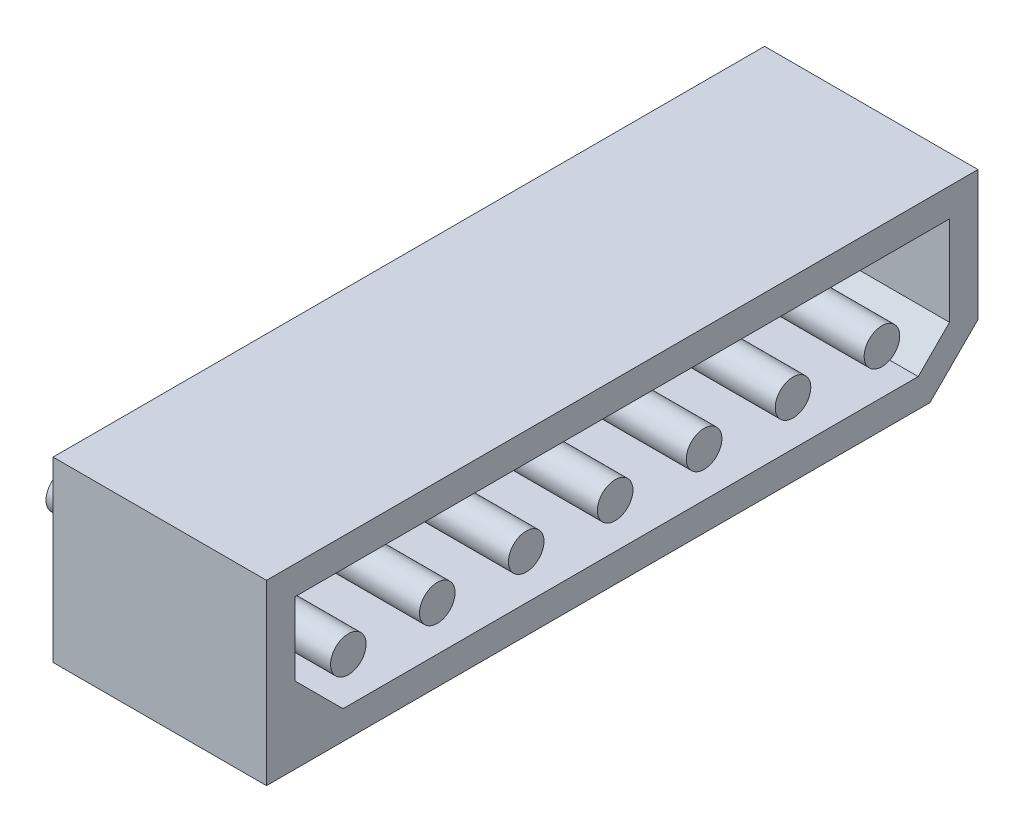
ISO-10303-21;
HEADER;
FILE_DESCRIPTION(('STEP AP214'),'2;1');
FILE_NAME('part.step','',(''),(''),'','','');
FILE_SCHEMA(('AUTOMOTIVE_DESIGN { 1 0 10303 214 1 1 1 1 }'));
ENDSEC;
DATA;
#1=APPLICATION_CONTEXT('core data for automotive mechanical design processes');
#2=APPLICATION_PROTOCOL_DEFINITION('international standard','automotive_design',2000,#1);
#3=PRODUCT_CONTEXT('',#1,'mechanical');
#4=PRODUCT('Part','Part','',(#3));
#5=PRODUCT_RELATED_PRODUCT_CATEGORY('part','',(#4));
#6=PRODUCT_DEFINITION_FORMATION('','',#4);
#7=PRODUCT_DEFINITION_CONTEXT('part definition',#1,'design');
#8=PRODUCT_DEFINITION('design','',#6,#7);
#9=PRODUCT_DEFINITION_SHAPE('','',#8);
#10=(LENGTH_UNIT() NAMED_UNIT(*) SI_UNIT(.MILLI.,.METRE.));
#11=(NAMED_UNIT(*) PLANE_ANGLE_UNIT() SI_UNIT($,.RADIAN.));
#12=(NAMED_UNIT(*) SI_UNIT($,.STERADIAN.) SOLID_ANGLE_UNIT());
#13=UNCERTAINTY_MEASURE_WITH_UNIT(LENGTH_MEASURE(1.E-05),#10,'distance_accuracy_value','');
#14=(GEOMETRIC_REPRESENTATION_CONTEXT(3) GLOBAL_UNCERTAINTY_ASSIGNED_CONTEXT((#13)) GLOBAL_UNIT_ASSIGNED_CONTEXT((#10,
#11,#12)) REPRESENTATION_CONTEXT('',''));
#15=CARTESIAN_POINT('',(0.,0.,0.));
#16=DIRECTION('',(0.,0.,1.));
#17=DIRECTION('',(1.,0.,0.));
#18=AXIS2_PLACEMENT_3D('',#15,#16,#17);
#19=CARTESIAN_POINT('',(5.8,-0.65,-7.5));
#20=DIRECTION('',(1.,0.,0.));
#21=DIRECTION('',(0.,0.,-1.));
#22=AXIS2_PLACEMENT_3D('',#19,#20,#21);
#23=PLANE('',#22);
#24=CARTESIAN_POINT('',(5.8,-0.65,-7.5));
#25=DIRECTION('',(1.,0.,0.));
#26=DIRECTION('',(0.,0.,-1.));
#27=AXIS2_PLACEMENT_3D('',#24,#25,#26);
#28=CIRCLE('',#27,0.5);
#29=CARTESIAN_POINT('',(5.8,-0.65,-8.));
#30=VERTEX_POINT('',#29);
#31=EDGE_CURVE('E19',#30,#30,#28,.F.);
#32=ORIENTED_EDGE('',*,*,#31,.F.);
#33=EDGE_LOOP('',(#32));
#34=FACE_BOUND('',#33,.T.);
#35=ADVANCED_FACE('F16',(#34),#23,.T.);
#36=CARTESIAN_POINT('',(5.8,-0.65,-5.));
#37=DIRECTION('',(1.,0.,0.));
#38=DIRECTION('',(0.,0.,-1.));
#39=AXIS2_PLACEMENT_3D('',#36,#37,#38);
#40=PLANE('',#39);
#41=CARTESIAN_POINT('',(5.8,-0.65,-5.));
#42=DIRECTION('',(1.,0.,0.));
#43=DIRECTION('',(0.,0.,-1.));
#44=AXIS2_PLACEMENT_3D('',#41,#42,#43);
#45=CIRCLE('',#44,0.5);
#46=CARTESIAN_POINT('',(5.8,-0.65,-5.5));
#47=VERTEX_POINT('',#46);
#48=EDGE_CURVE('E203',#47,#47,#45,.F.);
#49=ORIENTED_EDGE('',*,*,#48,.F.);
#50=EDGE_LOOP('',(#49));
#51=FACE_BOUND('',#50,.T.);
#52=ADVANCED_FACE('F214',(#51),#40,.T.);
#53=CARTESIAN_POINT('',(5.8,-0.65,-2.5));
#54=DIRECTION('',(1.,0.,0.));
#55=DIRECTION('',(0.,0.,-1.));
#56=AXIS2_PLACEMENT_3D('',#53,#54,#55);
#57=PLANE('',#56);
#58=CARTESIAN_POINT('',(5.8,-0.65,-2.5));
#59=DIRECTION('',(1.,0.,0.));
#60=DIRECTION('',(0.,0.,-1.));
#61=AXIS2_PLACEMENT_3D('',#58,#59,#60);
#62=CIRCLE('',#61,0.5);
#63=CARTESIAN_POINT('',(5.8,-0.65,-3.));
#64=VERTEX_POINT('',#63);
#65=EDGE_CURVE('E201',#64,#64,#62,.F.);
#66=ORIENTED_EDGE('',*,*,#65,.F.);
#67=EDGE_LOOP('',(#66));
#68=FACE_BOUND('',#67,.T.);
#69=ADVANCED_FACE('F219',(#68),#57,.T.);
#70=CARTESIAN_POINT('',(5.8,-0.65,0.));
#71=DIRECTION('',(1.,0.,0.));
#72=DIRECTION('',(0.,0.,-1.));
#73=AXIS2_PLACEMENT_3D('',#70,#71,#72);
#74=PLANE('',#73);
#75=CARTESIAN_POINT('',(5.8,-0.65,0.));
#76=DIRECTION('',(1.,0.,0.));
#77=DIRECTION('',(0.,0.,-1.));
#78=AXIS2_PLACEMENT_3D('',#75,#76,#77);
#79=CIRCLE('',#78,0.5);
#80=CARTESIAN_POINT('',(5.8,-0.65,-0.5));
#81=VERTEX_POINT('',#80);
#82=EDGE_CURVE('E198',#81,#81,#79,.F.);
#83=ORIENTED_EDGE('',*,*,#82,.F.);
#84=EDGE_LOOP('',(#83));
#85=FACE_BOUND('',#84,.T.);
#86=ADVANCED_FACE('F367',(#85),#74,.T.);
#87=CARTESIAN_POINT('',(5.8,-0.65,2.5));
#88=DIRECTION('',(1.,0.,0.));
#89=DIRECTION('',(0.,0.,-1.));
#90=AXIS2_PLACEMENT_3D('',#87,#88,#89);
#91=PLANE('',#90);
#92=CARTESIAN_POINT('',(5.8,-0.65,2.5));
#93=DIRECTION('',(1.,0.,0.));
#94=DIRECTION('',(0.,0.,-1.));
#95=AXIS2_PLACEMENT_3D('',#92,#93,#94);
#96=CIRCLE('',#95,0.5);
#97=CARTESIAN_POINT('',(5.8,-0.65,2.));
#98=VERTEX_POINT('',#97);
#99=EDGE_CURVE('E195',#98,#98,#96,.F.);
#100=ORIENTED_EDGE('',*,*,#99,.F.);
#101=EDGE_LOOP('',(#100));
#102=FACE_BOUND('',#101,.T.);
#103=ADVANCED_FACE('F363',(#102),#91,.T.);
#104=CARTESIAN_POINT('',(5.8,-0.65,5.));
#105=DIRECTION('',(1.,0.,0.));
#106=DIRECTION('',(0.,0.,-1.));
#107=AXIS2_PLACEMENT_3D('',#104,#105,#106);
#108=PLANE('',#107);
#109=CARTESIAN_POINT('',(5.8,-0.65,5.));
#110=DIRECTION('',(1.,0.,0.));
#111=DIRECTION('',(0.,0.,-1.));
#112=AXIS2_PLACEMENT_3D('',#109,#110,#111);
#113=CIRCLE('',#112,0.5);
#114=CARTESIAN_POINT('',(5.8,-0.65,4.5));
#115=VERTEX_POINT('',#114);
#116=EDGE_CURVE('E192',#115,#115,#113,.F.);
#117=ORIENTED_EDGE('',*,*,#116,.F.);
#118=EDGE_LOOP('',(#117));
#119=FACE_BOUND('',#118,.T.);
#120=ADVANCED_FACE('F359',(#119),#108,.T.);
#121=CARTESIAN_POINT('',(5.8,-0.65,7.5));
#122=DIRECTION('',(1.,0.,0.));
#123=DIRECTION('',(0.,0.,-1.));
#124=AXIS2_PLACEMENT_3D('',#121,#122,#123);
#125=PLANE('',#124);
#126=CARTESIAN_POINT('',(5.8,-0.65,7.5));
#127=DIRECTION('',(1.,0.,0.));
#128=DIRECTION('',(0.,0.,-1.));
#129=AXIS2_PLACEMENT_3D('',#126,#127,#128);
#130=CIRCLE('',#129,0.5);
#131=CARTESIAN_POINT('',(5.8,-0.65,7.));
#132=VERTEX_POINT('',#131);
#133=EDGE_CURVE('E189',#132,#132,#130,.F.);
#134=ORIENTED_EDGE('',*,*,#133,.F.);
#135=EDGE_LOOP('',(#134));
#136=FACE_BOUND('',#135,.T.);
#137=ADVANCED_FACE('F356',(#136),#125,.T.);
#138=CARTESIAN_POINT('',(5.8,-0.65,-7.5));
#139=DIRECTION('',(1.,0.,0.));
#140=DIRECTION('',(0.,0.,-1.));
#141=AXIS2_PLACEMENT_3D('',#138,#139,#140);
#142=CYLINDRICAL_SURFACE('',#141,0.5);
#143=ORIENTED_EDGE('',*,*,#31,.T.);
#144=EDGE_LOOP('',(#143));
#145=FACE_BOUND('',#144,.T.);
#146=CARTESIAN_POINT('',(0.8,-0.65,-7.5));
#147=DIRECTION('',(1.,0.,0.));
#148=DIRECTION('',(0.,0.,-1.));
#149=AXIS2_PLACEMENT_3D('',#146,#147,#148);
#150=CIRCLE('',#149,0.5);
#151=CARTESIAN_POINT('',(0.8,-0.65,-8.));
#152=VERTEX_POINT('',#151);
#153=EDGE_CURVE('E186',#152,#152,#150,.F.);
#154=ORIENTED_EDGE('',*,*,#153,.F.);
#155=EDGE_LOOP('',(#154));
#156=FACE_BOUND('',#155,.T.);
#157=ADVANCED_FACE('F210',(#145,#156),#142,.T.);
#158=CARTESIAN_POINT('',(5.8,-0.65,-5.));
#159=DIRECTION('',(1.,0.,0.));
#160=DIRECTION('',(0.,0.,-1.));
#161=AXIS2_PLACEMENT_3D('',#158,#159,#160);
#162=CYLINDRICAL_SURFACE('',#161,0.5);
#163=ORIENTED_EDGE('',*,*,#48,.T.);
#164=EDGE_LOOP('',(#163));
#165=FACE_BOUND('',#164,.T.);
#166=CARTESIAN_POINT('',(0.8,-0.65,-5.));
#167=DIRECTION('',(1.,0.,0.));
#168=DIRECTION('',(0.,0.,-1.));
#169=AXIS2_PLACEMENT_3D('',#166,#167,#168);
#170=CIRCLE('',#169,0.5);
#171=CARTESIAN_POINT('',(0.8,-0.65,-5.5));
#172=VERTEX_POINT('',#171);
#173=EDGE_CURVE('E183',#172,#172,#170,.F.);
#174=ORIENTED_EDGE('',*,*,#173,.F.);
#175=EDGE_LOOP('',(#174));
#176=FACE_BOUND('',#175,.T.);
#177=ADVANCED_FACE('F350',(#165,#176),#162,.T.);
#178=CARTESIAN_POINT('',(5.8,-0.65,-2.5));
#179=DIRECTION('',(1.,0.,0.));
#180=DIRECTION('',(0.,0.,-1.));
#181=AXIS2_PLACEMENT_3D('',#178,#179,#180);
#182=CYLINDRICAL_SURFACE('',#181,0.5);
#183=ORIENTED_EDGE('',*,*,#65,.T.);
#184=EDGE_LOOP('',(#183));
#185=FACE_BOUND('',#184,.T.);
#186=CARTESIAN_POINT('',(0.8,-0.65,-2.5));
#187=DIRECTION('',(1.,0.,0.));
#188=DIRECTION('',(0.,0.,-1.));
#189=AXIS2_PLACEMENT_3D('',#186,#187,#188);
#190=CIRCLE('',#189,0.5);
#191=CARTESIAN_POINT('',(0.8,-0.65,-3.));
#192=VERTEX_POINT('',#191);
#193=EDGE_CURVE('E180',#192,#192,#190,.F.);
#194=ORIENTED_EDGE('',*,*,#193,.F.);
#195=EDGE_LOOP('',(#194));
#196=FACE_BOUND('',#195,.T.);
#197=ADVANCED_FACE('F346',(#185,#196),#182,.T.);
#198=CARTESIAN_POINT('',(5.8,-0.65,0.));
#199=DIRECTION('',(1.,0.,0.));
#200=DIRECTION('',(0.,0.,-1.));
#201=AXIS2_PLACEMENT_3D('',#198,#199,#200);
#202=CYLINDRICAL_SURFACE('',#201,0.5);
#203=ORIENTED_EDGE('',*,*,#82,.T.);
#204=EDGE_LOOP('',(#203));
#205=FACE_BOUND('',#204,.T.);
#206=CARTESIAN_POINT('',(0.8,-0.65,0.));
#207=DIRECTION('',(1.,0.,0.));
#208=DIRECTION('',(0.,0.,-1.));
#209=AXIS2_PLACEMENT_3D('',#206,#207,#208);
#210=CIRCLE('',#209,0.5);
#211=CARTESIAN_POINT('',(0.8,-0.65,-0.5));
#212=VERTEX_POINT('',#211);
#213=EDGE_CURVE('E177',#212,#212,#210,.F.);
#214=ORIENTED_EDGE('',*,*,#213,.F.);
#215=EDGE_LOOP('',(#214));
#216=FACE_BOUND('',#215,.T.);
#217=ADVANCED_FACE('F342',(#205,#216),#202,.T.);
#218=CARTESIAN_POINT('',(5.8,-0.65,2.5));
#219=DIRECTION('',(1.,0.,0.));
#220=DIRECTION('',(0.,0.,-1.));
#221=AXIS2_PLACEMENT_3D('',#218,#219,#220);
#222=CYLINDRICAL_SURFACE('',#221,0.5);
#223=ORIENTED_EDGE('',*,*,#99,.T.);
#224=EDGE_LOOP('',(#223));
#225=FACE_BOUND('',#224,.T.);
#226=CARTESIAN_POINT('',(0.8,-0.65,2.5));
#227=DIRECTION('',(1.,0.,0.));
#228=DIRECTION('',(0.,0.,-1.));
#229=AXIS2_PLACEMENT_3D('',#226,#227,#228);
#230=CIRCLE('',#229,0.5);
#231=CARTESIAN_POINT('',(0.8,-0.65,2.));
#232=VERTEX_POINT('',#231);
#233=EDGE_CURVE('E174',#232,#232,#230,.F.);
#234=ORIENTED_EDGE('',*,*,#233,.F.);
#235=EDGE_LOOP('',(#234));
#236=FACE_BOUND('',#235,.T.);
#237=ADVANCED_FACE('F338',(#225,#236),#222,.T.);
#238=CARTESIAN_POINT('',(5.8,-0.65,5.));
#239=DIRECTION('',(1.,0.,0.));
#240=DIRECTION('',(0.,0.,-1.));
#241=AXIS2_PLACEMENT_3D('',#238,#239,#240);
#242=CYLINDRICAL_SURFACE('',#241,0.5);
#243=ORIENTED_EDGE('',*,*,#116,.T.);
#244=EDGE_LOOP('',(#243));
#245=FACE_BOUND('',#244,.T.);
#246=CARTESIAN_POINT('',(0.8,-0.65,5.));
#247=DIRECTION('',(1.,0.,0.));
#248=DIRECTION('',(0.,0.,-1.));
#249=AXIS2_PLACEMENT_3D('',#246,#247,#248);
#250=CIRCLE('',#249,0.5);
#251=CARTESIAN_POINT('',(0.8,-0.65,4.5));
#252=VERTEX_POINT('',#251);
#253=EDGE_CURVE('E171',#252,#252,#250,.F.);
#254=ORIENTED_EDGE('',*,*,#253,.F.);
#255=EDGE_LOOP('',(#254));
#256=FACE_BOUND('',#255,.T.);
#257=ADVANCED_FACE('F334',(#245,#256),#242,.T.);
#258=CARTESIAN_POINT('',(5.8,-0.65,7.5));
#259=DIRECTION('',(1.,0.,0.));
#260=DIRECTION('',(0.,0.,-1.));
#261=AXIS2_PLACEMENT_3D('',#258,#259,#260);
#262=CYLINDRICAL_SURFACE('',#261,0.5);
#263=ORIENTED_EDGE('',*,*,#133,.T.);
#264=EDGE_LOOP('',(#263));
#265=FACE_BOUND('',#264,.T.);
#266=CARTESIAN_POINT('',(0.8,-0.65,7.5));
#267=DIRECTION('',(1.,0.,0.));
#268=DIRECTION('',(0.,0.,-1.));
#269=AXIS2_PLACEMENT_3D('',#266,#267,#268);
#270=CIRCLE('',#269,0.5);
#271=CARTESIAN_POINT('',(0.8,-0.65,7.));
#272=VERTEX_POINT('',#271);
#273=EDGE_CURVE('E126',#272,#272,#270,.F.);
#274=ORIENTED_EDGE('',*,*,#273,.F.);
#275=EDGE_LOOP('',(#274));
#276=FACE_BOUND('',#275,.T.);
#277=ADVANCED_FACE('F330',(#265,#276),#262,.T.);
#278=CARTESIAN_POINT('',(0.8,0.,0.));
#279=DIRECTION('',(-1.,0.,0.));
#280=DIRECTION('',(0.,0.,1.));
#281=AXIS2_PLACEMENT_3D('',#278,#279,#280);
#282=PLANE('',#281);
#283=ORIENTED_EDGE('',*,*,#273,.T.);
#284=EDGE_LOOP('',(#283));
#285=FACE_BOUND('',#284,.T.);
#286=ORIENTED_EDGE('',*,*,#253,.T.);
#287=EDGE_LOOP('',(#286));
#288=FACE_BOUND('',#287,.T.);
#289=ORIENTED_EDGE('',*,*,#233,.T.);
#290=EDGE_LOOP('',(#289));
#291=FACE_BOUND('',#290,.T.);
#292=ORIENTED_EDGE('',*,*,#213,.T.);
#293=EDGE_LOOP('',(#292));
#294=FACE_BOUND('',#293,.T.);
#295=ORIENTED_EDGE('',*,*,#193,.T.);
#296=EDGE_LOOP('',(#295));
#297=FACE_BOUND('',#296,.T.);
#298=ORIENTED_EDGE('',*,*,#173,.T.);
#299=EDGE_LOOP('',(#298));
#300=FACE_BOUND('',#299,.T.);
#301=ORIENTED_EDGE('',*,*,#153,.T.);
#302=EDGE_LOOP('',(#301));
#303=FACE_BOUND('',#302,.T.);
#304=DIRECTION('',(0.,1.,0.));
#305=VECTOR('',#304,1.);
#306=CARTESIAN_POINT('',(0.8,-2.5,-9.2));
#307=LINE('',#306,#305);
#308=CARTESIAN_POINT('',(0.8,1.7,-9.2));
#309=VERTEX_POINT('',#308);
#310=CARTESIAN_POINT('',(0.8,-0.81862915,-9.2));
#311=VERTEX_POINT('',#310);
#312=EDGE_CURVE('E706',#309,#311,#307,.F.);
#313=ORIENTED_EDGE('',*,*,#312,.F.);
#314=DIRECTION('',(0.,0.,-1.));
#315=VECTOR('',#314,1.);
#316=CARTESIAN_POINT('',(0.8,1.7,10.));
#317=LINE('',#316,#315);
#318=CARTESIAN_POINT('',(0.8,1.7,9.2));
#319=VERTEX_POINT('',#318);
#320=EDGE_CURVE('E692',#319,#309,#317,.T.);
#321=ORIENTED_EDGE('',*,*,#320,.F.);
#322=DIRECTION('',(0.,1.,0.));
#323=VECTOR('',#322,1.);
#324=CARTESIAN_POINT('',(0.8,-2.5,9.2));
#325=LINE('',#324,#323);
#326=CARTESIAN_POINT('',(0.799999999999999,-0.35,9.2));
#327=VERTEX_POINT('',#326);
#328=EDGE_CURVE('E691',#327,#319,#325,.T.);
#329=ORIENTED_EDGE('',*,*,#328,.F.);
#330=DIRECTION('',(0.,0.707106781186548,0.707106781186548));
#331=VECTOR('',#330,1.);
#332=CARTESIAN_POINT('',(0.799999999999999,-0.35,9.2));
#333=LINE('',#332,#331);
#334=CARTESIAN_POINT('',(0.8,-1.7,7.85));
#335=VERTEX_POINT('',#334);
#336=EDGE_CURVE('E105',#335,#327,#333,.T.);
#337=ORIENTED_EDGE('',*,*,#336,.F.);
#338=DIRECTION('',(0.,0.,1.));
#339=VECTOR('',#338,1.);
#340=CARTESIAN_POINT('',(0.8,-1.7,10.));
#341=LINE('',#340,#339);
#342=CARTESIAN_POINT('',(0.799999999999999,-1.7,-8.31862915));
#343=VERTEX_POINT('',#342);
#344=EDGE_CURVE('E96',#343,#335,#341,.T.);
#345=ORIENTED_EDGE('',*,*,#344,.F.);
#346=DIRECTION('',(0.,-0.707106781186548,0.707106781186548));
#347=VECTOR('',#346,1.);
#348=CARTESIAN_POINT('',(0.799999999999999,-0.584314575,-9.434314575));
#349=LINE('',#348,#347);
#350=EDGE_CURVE('E102',#311,#343,#349,.T.);
#351=ORIENTED_EDGE('',*,*,#350,.F.);
#352=EDGE_LOOP('',(#313,#321,#329,#337,#345,#351));
#353=FACE_BOUND('',#352,.T.);
#354=ADVANCED_FACE('F101',(#285,#288,#291,#294,#297,#300,#303,#353),#282,.F.);
#355=CARTESIAN_POINT('',(6.,-0.584314575,-9.434314575));
#356=DIRECTION('',(0.,0.707106781186548,0.707106781186548));
#357=DIRECTION('',(0.,-0.707106781186548,0.707106781186548));
#358=AXIS2_PLACEMENT_3D('',#355,#356,#357);
#359=PLANE('',#358);
#360=ORIENTED_EDGE('',*,*,#350,.T.);
#361=DIRECTION('',(1.,0.,0.));
#362=VECTOR('',#361,1.);
#363=CARTESIAN_POINT('',(6.,-1.7,-8.31862915));
#364=LINE('',#363,#362);
#365=CARTESIAN_POINT('',(6.,-1.7,-8.31862915));
#366=VERTEX_POINT('',#365);
#367=EDGE_CURVE('E107',#366,#343,#364,.F.);
#368=ORIENTED_EDGE('',*,*,#367,.F.);
#369=DIRECTION('',(0.,-0.707106781186548,0.707106781186548));
#370=VECTOR('',#369,1.);
#371=CARTESIAN_POINT('',(6.,-0.584314575,-9.434314575));
#372=LINE('',#371,#370);
#373=CARTESIAN_POINT('',(6.,-0.81862915,-9.2));
#374=VERTEX_POINT('',#373);
#375=EDGE_CURVE('E116',#366,#374,#372,.F.);
#376=ORIENTED_EDGE('',*,*,#375,.T.);
#377=DIRECTION('',(1.,0.,0.));
#378=VECTOR('',#377,1.);
#379=CARTESIAN_POINT('',(6.,-0.81862915,-9.2));
#380=LINE('',#379,#378);
#381=EDGE_CURVE('E114',#311,#374,#380,.T.);
#382=ORIENTED_EDGE('',*,*,#381,.F.);
#383=EDGE_LOOP('',(#360,#368,#376,#382));
#384=FACE_BOUND('',#383,.T.);
#385=ADVANCED_FACE('F111',(#384),#359,.T.);
#386=CARTESIAN_POINT('',(6.,-1.7,10.));
#387=DIRECTION('',(0.,1.,0.));
#388=DIRECTION('',(0.,0.,1.));
#389=AXIS2_PLACEMENT_3D('',#386,#387,#388);
#390=PLANE('',#389);
#391=DIRECTION('',(0.,0.,1.));
#392=VECTOR('',#391,1.);
#393=CARTESIAN_POINT('',(6.,-1.7,0.));
#394=LINE('',#393,#392);
#395=CARTESIAN_POINT('',(6.,-1.7,7.85));
#396=VERTEX_POINT('',#395);
#397=EDGE_CURVE('E120',#366,#396,#394,.T.);
#398=ORIENTED_EDGE('',*,*,#397,.F.);
#399=ORIENTED_EDGE('',*,*,#367,.T.);
#400=ORIENTED_EDGE('',*,*,#344,.T.);
#401=DIRECTION('',(1.,0.,0.));
#402=VECTOR('',#401,1.);
#403=CARTESIAN_POINT('',(6.,-1.7,7.85));
#404=LINE('',#403,#402);
#405=EDGE_CURVE('E121',#396,#335,#404,.F.);
#406=ORIENTED_EDGE('',*,*,#405,.F.);
#407=EDGE_LOOP('',(#398,#399,#400,#406));
#408=FACE_BOUND('',#407,.T.);
#409=ADVANCED_FACE('F118',(#408),#390,.T.);
#410=CARTESIAN_POINT('',(6.,-0.35,9.2));
#411=DIRECTION('',(0.,0.707106781186548,-0.707106781186548));
#412=DIRECTION('',(0.,0.707106781186548,0.707106781186548));
#413=AXIS2_PLACEMENT_3D('',#410,#411,#412);
#414=PLANE('',#413);
#415=ORIENTED_EDGE('',*,*,#336,.T.);
#416=DIRECTION('',(-1.,0.,0.));
#417=VECTOR('',#416,1.);
#418=CARTESIAN_POINT('',(6.,-0.35,9.2));
#419=LINE('',#418,#417);
#420=CARTESIAN_POINT('',(6.,-0.35,9.2));
#421=VERTEX_POINT('',#420);
#422=EDGE_CURVE('E688',#421,#327,#419,.T.);
#423=ORIENTED_EDGE('',*,*,#422,.F.);
#424=DIRECTION('',(0.,0.707106781186547,0.707106781186548));
#425=VECTOR('',#424,1.);
#426=CARTESIAN_POINT('',(6.,-1.7,7.85));
#427=LINE('',#426,#425);
#428=EDGE_CURVE('E710',#396,#421,#427,.T.);
#429=ORIENTED_EDGE('',*,*,#428,.F.);
#430=ORIENTED_EDGE('',*,*,#405,.T.);
#431=EDGE_LOOP('',(#415,#423,#429,#430));
#432=FACE_BOUND('',#431,.T.);
#433=ADVANCED_FACE('F319',(#432),#414,.T.);
#434=CARTESIAN_POINT('',(6.,-2.5,9.2));
#435=DIRECTION('',(0.,0.,-1.));
#436=DIRECTION('',(-1.,0.,0.));
#437=AXIS2_PLACEMENT_3D('',#434,#435,#436);
#438=PLANE('',#437);
#439=ORIENTED_EDGE('',*,*,#328,.T.);
#440=DIRECTION('',(1.,0.,0.));
#441=VECTOR('',#440,1.);
#442=CARTESIAN_POINT('',(6.,1.7,9.2));
#443=LINE('',#442,#441);
#444=CARTESIAN_POINT('',(6.,1.7,9.2));
#445=VERTEX_POINT('',#444);
#446=EDGE_CURVE('E701',#445,#319,#443,.F.);
#447=ORIENTED_EDGE('',*,*,#446,.F.);
#448=DIRECTION('',(0.,1.,0.));
#449=VECTOR('',#448,1.);
#450=CARTESIAN_POINT('',(6.,0.,9.2));
#451=LINE('',#450,#449);
#452=EDGE_CURVE('E696',#421,#445,#451,.T.);
#453=ORIENTED_EDGE('',*,*,#452,.F.);
#454=ORIENTED_EDGE('',*,*,#422,.T.);
#455=EDGE_LOOP('',(#439,#447,#453,#454));
#456=FACE_BOUND('',#455,.T.);
#457=ADVANCED_FACE('F315',(#456),#438,.T.);
#458=CARTESIAN_POINT('',(6.,1.7,10.));
#459=DIRECTION('',(0.,-1.,0.));
#460=DIRECTION('',(0.,0.,-1.));
#461=AXIS2_PLACEMENT_3D('',#458,#459,#460);
#462=PLANE('',#461);
#463=DIRECTION('',(0.,0.,1.));
#464=VECTOR('',#463,1.);
#465=CARTESIAN_POINT('',(6.,1.7,0.));
#466=LINE('',#465,#464);
#467=CARTESIAN_POINT('',(6.,1.7,-9.2));
#468=VERTEX_POINT('',#467);
#469=EDGE_CURVE('E713',#445,#468,#466,.F.);
#470=ORIENTED_EDGE('',*,*,#469,.F.);
#471=ORIENTED_EDGE('',*,*,#446,.T.);
#472=ORIENTED_EDGE('',*,*,#320,.T.);
#473=DIRECTION('',(1.,0.,0.));
#474=VECTOR('',#473,1.);
#475=CARTESIAN_POINT('',(6.,1.7,-9.2));
#476=LINE('',#475,#474);
#477=EDGE_CURVE('E703',#468,#309,#476,.F.);
#478=ORIENTED_EDGE('',*,*,#477,.F.);
#479=EDGE_LOOP('',(#470,#471,#472,#478));
#480=FACE_BOUND('',#479,.T.);
#481=ADVANCED_FACE('F311',(#480),#462,.T.);
#482=CARTESIAN_POINT('',(6.,-2.5,-9.2));
#483=DIRECTION('',(0.,0.,1.));
#484=DIRECTION('',(1.,0.,0.));
#485=AXIS2_PLACEMENT_3D('',#482,#483,#484);
#486=PLANE('',#485);
#487=ORIENTED_EDGE('',*,*,#312,.T.);
#488=ORIENTED_EDGE('',*,*,#381,.T.);
#489=DIRECTION('',(0.,1.,0.));
#490=VECTOR('',#489,1.);
#491=CARTESIAN_POINT('',(6.,0.,-9.2));
#492=LINE('',#491,#490);
#493=EDGE_CURVE('E716',#468,#374,#492,.F.);
#494=ORIENTED_EDGE('',*,*,#493,.F.);
#495=ORIENTED_EDGE('',*,*,#477,.T.);
#496=EDGE_LOOP('',(#487,#488,#494,#495));
#497=FACE_BOUND('',#496,.T.);
#498=ADVANCED_FACE('F307',(#497),#486,.T.);
#499=CARTESIAN_POINT('',(6.,0.,0.));
#500=DIRECTION('',(-1.,0.,0.));
#501=DIRECTION('',(0.,0.,1.));
#502=AXIS2_PLACEMENT_3D('',#499,#500,#501);
#503=PLANE('',#502);
#504=ORIENTED_EDGE('',*,*,#493,.T.);
#505=ORIENTED_EDGE('',*,*,#375,.F.);
#506=ORIENTED_EDGE('',*,*,#397,.T.);
#507=ORIENTED_EDGE('',*,*,#428,.T.);
#508=ORIENTED_EDGE('',*,*,#452,.T.);
#509=ORIENTED_EDGE('',*,*,#469,.T.);
#510=EDGE_LOOP('',(#504,#505,#506,#507,#508,#509));
#511=FACE_BOUND('',#510,.T.);
#512=DIRECTION('',(0.,0.,-1.));
#513=VECTOR('',#512,1.);
#514=CARTESIAN_POINT('',(6.,2.5,10.));
#515=LINE('',#514,#513);
#516=CARTESIAN_POINT('',(6.,2.5,10.));
#517=VERTEX_POINT('',#516);
#518=CARTESIAN_POINT('',(6.,2.5,-10.));
#519=VERTEX_POINT('',#518);
#520=EDGE_CURVE('E738',#517,#519,#515,.T.);
#521=ORIENTED_EDGE('',*,*,#520,.F.);
#522=DIRECTION('',(0.,1.,0.));
#523=VECTOR('',#522,1.);
#524=CARTESIAN_POINT('',(6.,-2.5,10.));
#525=LINE('',#524,#523);
#526=CARTESIAN_POINT('',(6.,-2.5,10.));
#527=VERTEX_POINT('',#526);
#528=EDGE_CURVE('E735',#527,#517,#525,.T.);
#529=ORIENTED_EDGE('',*,*,#528,.F.);
#530=DIRECTION('',(0.,0.,1.));
#531=VECTOR('',#530,1.);
#532=CARTESIAN_POINT('',(6.,-2.5,10.));
#533=LINE('',#532,#531);
#534=CARTESIAN_POINT('',(6.,-2.5,-8.65));
#535=VERTEX_POINT('',#534);
#536=EDGE_CURVE('E730',#535,#527,#533,.T.);
#537=ORIENTED_EDGE('',*,*,#536,.F.);
#538=DIRECTION('',(0.,-0.707106781186548,0.707106781186548));
#539=VECTOR('',#538,1.);
#540=CARTESIAN_POINT('',(6.,-1.15,-10.));
#541=LINE('',#540,#539);
#542=CARTESIAN_POINT('',(6.,-1.15,-10.));
#543=VERTEX_POINT('',#542);
#544=EDGE_CURVE('E722',#543,#535,#541,.T.);
#545=ORIENTED_EDGE('',*,*,#544,.F.);
#546=DIRECTION('',(0.,1.,0.));
#547=VECTOR('',#546,1.);
#548=CARTESIAN_POINT('',(6.,-2.5,-10.));
#549=LINE('',#548,#547);
#550=EDGE_CURVE('E719',#519,#543,#549,.F.);
#551=ORIENTED_EDGE('',*,*,#550,.F.);
#552=EDGE_LOOP('',(#521,#529,#537,#545,#551));
#553=FACE_BOUND('',#552,.T.);
#554=ADVANCED_FACE('F303',(#511,#553),#503,.F.);
#555=CARTESIAN_POINT('',(-2.2,-0.65,-5.));
#556=DIRECTION('',(1.,0.,0.));
#557=DIRECTION('',(0.,0.,-1.));
#558=AXIS2_PLACEMENT_3D('',#555,#556,#557);
#559=PLANE('',#558);
#560=CARTESIAN_POINT('',(-2.2,-0.65,-5.));
#561=DIRECTION('',(1.,0.,0.));
#562=DIRECTION('',(0.,0.,-1.));
#563=AXIS2_PLACEMENT_3D('',#560,#561,#562);
#564=CIRCLE('',#563,0.5);
#565=CARTESIAN_POINT('',(-2.2,-0.65,-5.5));
#566=VERTEX_POINT('',#565);
#567=EDGE_CURVE('E165',#566,#566,#564,.T.);
#568=ORIENTED_EDGE('',*,*,#567,.F.);
#569=EDGE_LOOP('',(#568));
#570=FACE_BOUND('',#569,.T.);
#571=ADVANCED_FACE('F299',(#570),#559,.F.);
#572=CARTESIAN_POINT('',(-2.2,-0.65,-2.5));
#573=DIRECTION('',(1.,0.,0.));
#574=DIRECTION('',(0.,0.,-1.));
#575=AXIS2_PLACEMENT_3D('',#572,#573,#574);
#576=PLANE('',#575);
#577=CARTESIAN_POINT('',(-2.2,-0.65,-2.5));
#578=DIRECTION('',(1.,0.,0.));
#579=DIRECTION('',(0.,0.,-1.));
#580=AXIS2_PLACEMENT_3D('',#577,#578,#579);
#581=CIRCLE('',#580,0.5);
#582=CARTESIAN_POINT('',(-2.2,-0.65,-3.));
#583=VERTEX_POINT('',#582);
#584=EDGE_CURVE('E162',#583,#583,#581,.T.);
#585=ORIENTED_EDGE('',*,*,#584,.F.);
#586=EDGE_LOOP('',(#585));
#587=FACE_BOUND('',#586,.T.);
#588=ADVANCED_FACE('F295',(#587),#576,.F.);
#589=CARTESIAN_POINT('',(-2.2,-0.65,0.));
#590=DIRECTION('',(1.,0.,0.));
#591=DIRECTION('',(0.,0.,-1.));
#592=AXIS2_PLACEMENT_3D('',#589,#590,#591);
#593=PLANE('',#592);
#594=CARTESIAN_POINT('',(-2.2,-0.65,0.));
#595=DIRECTION('',(1.,0.,0.));
#596=DIRECTION('',(0.,0.,-1.));
#597=AXIS2_PLACEMENT_3D('',#594,#595,#596);
#598=CIRCLE('',#597,0.5);
#599=CARTESIAN_POINT('',(-2.2,-0.65,-0.5));
#600=VERTEX_POINT('',#599);
#601=EDGE_CURVE('E159',#600,#600,#598,.T.);
#602=ORIENTED_EDGE('',*,*,#601,.F.);
#603=EDGE_LOOP('',(#602));
#604=FACE_BOUND('',#603,.T.);
#605=ADVANCED_FACE('F291',(#604),#593,.F.);
#606=CARTESIAN_POINT('',(-2.2,-0.65,2.5));
#607=DIRECTION('',(1.,0.,0.));
#608=DIRECTION('',(0.,0.,-1.));
#609=AXIS2_PLACEMENT_3D('',#606,#607,#608);
#610=PLANE('',#609);
#611=CARTESIAN_POINT('',(-2.2,-0.65,2.5));
#612=DIRECTION('',(1.,0.,0.));
#613=DIRECTION('',(0.,0.,-1.));
#614=AXIS2_PLACEMENT_3D('',#611,#612,#613);
#615=CIRCLE('',#614,0.5);
#616=CARTESIAN_POINT('',(-2.2,-0.65,2.));
#617=VERTEX_POINT('',#616);
#618=EDGE_CURVE('E156',#617,#617,#615,.T.);
#619=ORIENTED_EDGE('',*,*,#618,.F.);
#620=EDGE_LOOP('',(#619));
#621=FACE_BOUND('',#620,.T.);
#622=ADVANCED_FACE('F287',(#621),#610,.F.);
#623=CARTESIAN_POINT('',(-2.2,-0.65,5.));
#624=DIRECTION('',(1.,0.,0.));
#625=DIRECTION('',(0.,0.,-1.));
#626=AXIS2_PLACEMENT_3D('',#623,#624,#625);
#627=PLANE('',#626);
#628=CARTESIAN_POINT('',(-2.2,-0.65,5.));
#629=DIRECTION('',(1.,0.,0.));
#630=DIRECTION('',(0.,0.,-1.));
#631=AXIS2_PLACEMENT_3D('',#628,#629,#630);
#632=CIRCLE('',#631,0.5);
#633=CARTESIAN_POINT('',(-2.2,-0.65,4.5));
#634=VERTEX_POINT('',#633);
#635=EDGE_CURVE('E153',#634,#634,#632,.T.);
#636=ORIENTED_EDGE('',*,*,#635,.F.);
#637=EDGE_LOOP('',(#636));
#638=FACE_BOUND('',#637,.T.);
#639=ADVANCED_FACE('F283',(#638),#627,.F.);
#640=CARTESIAN_POINT('',(-2.2,-0.65,7.5));
#641=DIRECTION('',(1.,0.,0.));
#642=DIRECTION('',(0.,0.,-1.));
#643=AXIS2_PLACEMENT_3D('',#640,#641,#642);
#644=PLANE('',#643);
#645=CARTESIAN_POINT('',(-2.2,-0.65,7.5));
#646=DIRECTION('',(1.,0.,0.));
#647=DIRECTION('',(0.,0.,-1.));
#648=AXIS2_PLACEMENT_3D('',#645,#646,#647);
#649=CIRCLE('',#648,0.5);
#650=CARTESIAN_POINT('',(-2.2,-0.65,7.));
#651=VERTEX_POINT('',#650);
#652=EDGE_CURVE('E149',#651,#651,#649,.T.);
#653=ORIENTED_EDGE('',*,*,#652,.F.);
#654=EDGE_LOOP('',(#653));
#655=FACE_BOUND('',#654,.T.);
#656=ADVANCED_FACE('F279',(#655),#644,.F.);
#657=CARTESIAN_POINT('',(6.,-2.5,-10.));
#658=DIRECTION('',(0.,0.,1.));
#659=DIRECTION('',(1.,0.,0.));
#660=AXIS2_PLACEMENT_3D('',#657,#658,#659);
#661=PLANE('',#660);
#662=DIRECTION('',(0.,1.,0.));
#663=VECTOR('',#662,1.);
#664=CARTESIAN_POINT('',(0.,0.,-10.));
#665=LINE('',#664,#663);
#666=CARTESIAN_POINT('',(0.,2.5,-10.));
#667=VERTEX_POINT('',#666);
#668=CARTESIAN_POINT('',(0.,-1.15,-10.));
#669=VERTEX_POINT('',#668);
#670=EDGE_CURVE('E152',#667,#669,#665,.F.);
#671=ORIENTED_EDGE('',*,*,#670,.F.);
#672=DIRECTION('',(1.,0.,0.));
#673=VECTOR('',#672,1.);
#674=CARTESIAN_POINT('',(6.,2.5,-10.));
#675=LINE('',#674,#673);
#676=EDGE_CURVE('E168',#519,#667,#675,.F.);
#677=ORIENTED_EDGE('',*,*,#676,.F.);
#678=ORIENTED_EDGE('',*,*,#550,.T.);
#679=DIRECTION('',(1.,0.,0.));
#680=VECTOR('',#679,1.);
#681=CARTESIAN_POINT('',(6.,-1.15,-10.));
#682=LINE('',#681,#680);
#683=EDGE_CURVE('E724',#669,#543,#682,.T.);
#684=ORIENTED_EDGE('',*,*,#683,.F.);
#685=EDGE_LOOP('',(#671,#677,#678,#684));
#686=FACE_BOUND('',#685,.T.);
#687=ADVANCED_FACE('F275',(#686),#661,.F.);
#688=CARTESIAN_POINT('',(6.,-1.15,-10.));
#689=DIRECTION('',(0.,0.707106781186548,0.707106781186548));
#690=DIRECTION('',(0.,-0.707106781186548,0.707106781186548));
#691=AXIS2_PLACEMENT_3D('',#688,#689,#690);
#692=PLANE('',#691);
#693=DIRECTION('',(0.,-0.707106781186547,0.707106781186548));
#694=VECTOR('',#693,1.);
#695=CARTESIAN_POINT('',(0.,-1.15,-10.));
#696=LINE('',#695,#694);
#697=CARTESIAN_POINT('',(0.,-2.5,-8.65));
#698=VERTEX_POINT('',#697);
#699=EDGE_CURVE('E745',#669,#698,#696,.T.);
#700=ORIENTED_EDGE('',*,*,#699,.F.);
#701=ORIENTED_EDGE('',*,*,#683,.T.);
#702=ORIENTED_EDGE('',*,*,#544,.T.);
#703=DIRECTION('',(1.,0.,0.));
#704=VECTOR('',#703,1.);
#705=CARTESIAN_POINT('',(6.,-2.5,-8.65));
#706=LINE('',#705,#704);
#707=EDGE_CURVE('E727',#698,#535,#706,.T.);
#708=ORIENTED_EDGE('',*,*,#707,.F.);
#709=EDGE_LOOP('',(#700,#701,#702,#708));
#710=FACE_BOUND('',#709,.T.);
#711=ADVANCED_FACE('F271',(#710),#692,.F.);
#712=CARTESIAN_POINT('',(6.,-2.5,10.));
#713=DIRECTION('',(0.,1.,0.));
#714=DIRECTION('',(0.,0.,1.));
#715=AXIS2_PLACEMENT_3D('',#712,#713,#714);
#716=PLANE('',#715);
#717=ORIENTED_EDGE('',*,*,#536,.T.);
#718=DIRECTION('',(-1.,0.,0.));
#719=VECTOR('',#718,1.);
#720=CARTESIAN_POINT('',(6.,-2.5,10.));
#721=LINE('',#720,#719);
#722=CARTESIAN_POINT('',(0.,-2.5,10.));
#723=VERTEX_POINT('',#722);
#724=EDGE_CURVE('E732',#723,#527,#721,.F.);
#725=ORIENTED_EDGE('',*,*,#724,.F.);
#726=DIRECTION('',(0.,0.,1.));
#727=VECTOR('',#726,1.);
#728=CARTESIAN_POINT('',(0.,-2.5,0.));
#729=LINE('',#728,#727);
#730=EDGE_CURVE('E748',#698,#723,#729,.T.);
#731=ORIENTED_EDGE('',*,*,#730,.F.);
#732=ORIENTED_EDGE('',*,*,#707,.T.);
#733=EDGE_LOOP('',(#717,#725,#731,#732));
#734=FACE_BOUND('',#733,.T.);
#735=ADVANCED_FACE('F268',(#734),#716,.F.);
#736=CARTESIAN_POINT('',(6.,-2.5,10.));
#737=DIRECTION('',(0.,0.,-1.));
#738=DIRECTION('',(-1.,0.,0.));
#739=AXIS2_PLACEMENT_3D('',#736,#737,#738);
#740=PLANE('',#739);
#741=ORIENTED_EDGE('',*,*,#528,.T.);
#742=DIRECTION('',(1.,0.,0.));
#743=VECTOR('',#742,1.);
#744=CARTESIAN_POINT('',(6.,2.5,10.));
#745=LINE('',#744,#743);
#746=CARTESIAN_POINT('',(0.,2.5,10.));
#747=VERTEX_POINT('',#746);
#748=EDGE_CURVE('E34',#747,#517,#745,.T.);
#749=ORIENTED_EDGE('',*,*,#748,.F.);
#750=DIRECTION('',(0.,1.,0.));
#751=VECTOR('',#750,1.);
#752=CARTESIAN_POINT('',(0.,0.,10.));
#753=LINE('',#752,#751);
#754=EDGE_CURVE('E751',#723,#747,#753,.T.);
#755=ORIENTED_EDGE('',*,*,#754,.F.);
#756=ORIENTED_EDGE('',*,*,#724,.T.);
#757=EDGE_LOOP('',(#741,#749,#755,#756));
#758=FACE_BOUND('',#757,.T.);
#759=ADVANCED_FACE('F264',(#758),#740,.F.);
#760=CARTESIAN_POINT('',(6.,2.5,10.));
#761=DIRECTION('',(0.,-1.,0.));
#762=DIRECTION('',(0.,0.,-1.));
#763=AXIS2_PLACEMENT_3D('',#760,#761,#762);
#764=PLANE('',#763);
#765=ORIENTED_EDGE('',*,*,#520,.T.);
#766=ORIENTED_EDGE('',*,*,#676,.T.);
#767=DIRECTION('',(0.,0.,1.));
#768=VECTOR('',#767,1.);
#769=CARTESIAN_POINT('',(0.,2.5,0.));
#770=LINE('',#769,#768);
#771=EDGE_CURVE('E148',#747,#667,#770,.F.);
#772=ORIENTED_EDGE('',*,*,#771,.F.);
#773=ORIENTED_EDGE('',*,*,#748,.T.);
#774=EDGE_LOOP('',(#765,#766,#772,#773));
#775=FACE_BOUND('',#774,.T.);
#776=ADVANCED_FACE('F260',(#775),#764,.F.);
#777=CARTESIAN_POINT('',(0.,-0.65,-5.));
#778=DIRECTION('',(1.,0.,0.));
#779=DIRECTION('',(0.,0.,-1.));
#780=AXIS2_PLACEMENT_3D('',#777,#778,#779);
#781=CYLINDRICAL_SURFACE('',#780,0.5);
#782=CARTESIAN_POINT('',(0.,-0.65,-5.));
#783=DIRECTION('',(1.,0.,0.));
#784=DIRECTION('',(0.,0.,-1.));
#785=AXIS2_PLACEMENT_3D('',#782,#783,#784);
#786=CIRCLE('',#785,0.5);
#787=CARTESIAN_POINT('',(0.,-0.65,-5.5));
#788=VERTEX_POINT('',#787);
#789=EDGE_CURVE('E145',#788,#788,#786,.T.);
#790=ORIENTED_EDGE('',*,*,#789,.F.);
#791=EDGE_LOOP('',(#790));
#792=FACE_BOUND('',#791,.T.);
#793=ORIENTED_EDGE('',*,*,#567,.T.);
#794=EDGE_LOOP('',(#793));
#795=FACE_BOUND('',#794,.T.);
#796=ADVANCED_FACE('F256',(#792,#795),#781,.T.);
#797=CARTESIAN_POINT('',(0.,-0.65,-2.5));
#798=DIRECTION('',(1.,0.,0.));
#799=DIRECTION('',(0.,0.,-1.));
#800=AXIS2_PLACEMENT_3D('',#797,#798,#799);
#801=CYLINDRICAL_SURFACE('',#800,0.5);
#802=CARTESIAN_POINT('',(0.,-0.65,-2.5));
#803=DIRECTION('',(1.,0.,0.));
#804=DIRECTION('',(0.,0.,-1.));
#805=AXIS2_PLACEMENT_3D('',#802,#803,#804);
#806=CIRCLE('',#805,0.5);
#807=CARTESIAN_POINT('',(0.,-0.65,-3.));
#808=VERTEX_POINT('',#807);
#809=EDGE_CURVE('E142',#808,#808,#806,.T.);
#810=ORIENTED_EDGE('',*,*,#809,.F.);
#811=EDGE_LOOP('',(#810));
#812=FACE_BOUND('',#811,.T.);
#813=ORIENTED_EDGE('',*,*,#584,.T.);
#814=EDGE_LOOP('',(#813));
#815=FACE_BOUND('',#814,.T.);
#816=ADVANCED_FACE('F252',(#812,#815),#801,.T.);
#817=CARTESIAN_POINT('',(0.,-0.65,0.));
#818=DIRECTION('',(1.,0.,0.));
#819=DIRECTION('',(0.,0.,-1.));
#820=AXIS2_PLACEMENT_3D('',#817,#818,#819);
#821=CYLINDRICAL_SURFACE('',#820,0.5);
#822=CARTESIAN_POINT('',(0.,-0.65,0.));
#823=DIRECTION('',(1.,0.,0.));
#824=DIRECTION('',(0.,0.,-1.));
#825=AXIS2_PLACEMENT_3D('',#822,#823,#824);
#826=CIRCLE('',#825,0.5);
#827=CARTESIAN_POINT('',(0.,-0.65,-0.5));
#828=VERTEX_POINT('',#827);
#829=EDGE_CURVE('E139',#828,#828,#826,.T.);
#830=ORIENTED_EDGE('',*,*,#829,.F.);
#831=EDGE_LOOP('',(#830));
#832=FACE_BOUND('',#831,.T.);
#833=ORIENTED_EDGE('',*,*,#601,.T.);
#834=EDGE_LOOP('',(#833));
#835=FACE_BOUND('',#834,.T.);
#836=ADVANCED_FACE('F248',(#832,#835),#821,.T.);
#837=CARTESIAN_POINT('',(0.,-0.65,2.5));
#838=DIRECTION('',(1.,0.,0.));
#839=DIRECTION('',(0.,0.,-1.));
#840=AXIS2_PLACEMENT_3D('',#837,#838,#839);
#841=CYLINDRICAL_SURFACE('',#840,0.5);
#842=CARTESIAN_POINT('',(0.,-0.65,2.5));
#843=DIRECTION('',(1.,0.,0.));
#844=DIRECTION('',(0.,0.,-1.));
#845=AXIS2_PLACEMENT_3D('',#842,#843,#844);
#846=CIRCLE('',#845,0.5);
#847=CARTESIAN_POINT('',(0.,-0.65,2.));
#848=VERTEX_POINT('',#847);
#849=EDGE_CURVE('E136',#848,#848,#846,.T.);
#850=ORIENTED_EDGE('',*,*,#849,.F.);
#851=EDGE_LOOP('',(#850));
#852=FACE_BOUND('',#851,.T.);
#853=ORIENTED_EDGE('',*,*,#618,.T.);
#854=EDGE_LOOP('',(#853));
#855=FACE_BOUND('',#854,.T.);
#856=ADVANCED_FACE('F244',(#852,#855),#841,.T.);
#857=CARTESIAN_POINT('',(0.,-0.65,5.));
#858=DIRECTION('',(1.,0.,0.));
#859=DIRECTION('',(0.,0.,-1.));
#860=AXIS2_PLACEMENT_3D('',#857,#858,#859);
#861=CYLINDRICAL_SURFACE('',#860,0.5);
#862=CARTESIAN_POINT('',(0.,-0.65,5.));
#863=DIRECTION('',(1.,0.,0.));
#864=DIRECTION('',(0.,0.,-1.));
#865=AXIS2_PLACEMENT_3D('',#862,#863,#864);
#866=CIRCLE('',#865,0.5);
#867=CARTESIAN_POINT('',(0.,-0.65,4.5));
#868=VERTEX_POINT('',#867);
#869=EDGE_CURVE('E133',#868,#868,#866,.T.);
#870=ORIENTED_EDGE('',*,*,#869,.F.);
#871=EDGE_LOOP('',(#870));
#872=FACE_BOUND('',#871,.T.);
#873=ORIENTED_EDGE('',*,*,#635,.T.);
#874=EDGE_LOOP('',(#873));
#875=FACE_BOUND('',#874,.T.);
#876=ADVANCED_FACE('F240',(#872,#875),#861,.T.);
#877=CARTESIAN_POINT('',(0.,-0.65,7.5));
#878=DIRECTION('',(1.,0.,0.));
#879=DIRECTION('',(0.,0.,-1.));
#880=AXIS2_PLACEMENT_3D('',#877,#878,#879);
#881=CYLINDRICAL_SURFACE('',#880,0.5);
#882=CARTESIAN_POINT('',(0.,-0.65,7.5));
#883=DIRECTION('',(1.,0.,0.));
#884=DIRECTION('',(0.,0.,-1.));
#885=AXIS2_PLACEMENT_3D('',#882,#883,#884);
#886=CIRCLE('',#885,0.5);
#887=CARTESIAN_POINT('',(0.,-0.65,7.));
#888=VERTEX_POINT('',#887);
#889=EDGE_CURVE('E130',#888,#888,#886,.T.);
#890=ORIENTED_EDGE('',*,*,#889,.F.);
#891=EDGE_LOOP('',(#890));
#892=FACE_BOUND('',#891,.T.);
#893=ORIENTED_EDGE('',*,*,#652,.T.);
#894=EDGE_LOOP('',(#893));
#895=FACE_BOUND('',#894,.T.);
#896=ADVANCED_FACE('F236',(#892,#895),#881,.T.);
#897=CARTESIAN_POINT('',(-2.2,-0.65,-7.5));
#898=DIRECTION('',(1.,0.,0.));
#899=DIRECTION('',(0.,0.,-1.));
#900=AXIS2_PLACEMENT_3D('',#897,#898,#899);
#901=PLANE('',#900);
#902=CARTESIAN_POINT('',(-2.2,-0.65,-7.5));
#903=DIRECTION('',(1.,0.,0.));
#904=DIRECTION('',(0.,0.,-1.));
#905=AXIS2_PLACEMENT_3D('',#902,#903,#904);
#906=CIRCLE('',#905,0.5);
#907=CARTESIAN_POINT('',(-2.2,-0.65,-8.));
#908=VERTEX_POINT('',#907);
#909=EDGE_CURVE('E25',#908,#908,#906,.T.);
#910=ORIENTED_EDGE('',*,*,#909,.F.);
#911=EDGE_LOOP('',(#910));
#912=FACE_BOUND('',#911,.T.);
#913=ADVANCED_FACE('F229',(#912),#901,.F.);
#914=CARTESIAN_POINT('',(0.,0.,0.));
#915=DIRECTION('',(-1.,0.,0.));
#916=DIRECTION('',(0.,0.,1.));
#917=AXIS2_PLACEMENT_3D('',#914,#915,#916);
#918=PLANE('',#917);
#919=ORIENTED_EDGE('',*,*,#889,.T.);
#920=EDGE_LOOP('',(#919));
#921=FACE_BOUND('',#920,.T.);
#922=ORIENTED_EDGE('',*,*,#869,.T.);
#923=EDGE_LOOP('',(#922));
#924=FACE_BOUND('',#923,.T.);
#925=ORIENTED_EDGE('',*,*,#849,.T.);
#926=EDGE_LOOP('',(#925));
#927=FACE_BOUND('',#926,.T.);
#928=ORIENTED_EDGE('',*,*,#829,.T.);
#929=EDGE_LOOP('',(#928));
#930=FACE_BOUND('',#929,.T.);
#931=ORIENTED_EDGE('',*,*,#809,.T.);
#932=EDGE_LOOP('',(#931));
#933=FACE_BOUND('',#932,.T.);
#934=ORIENTED_EDGE('',*,*,#789,.T.);
#935=EDGE_LOOP('',(#934));
#936=FACE_BOUND('',#935,.T.);
#937=CARTESIAN_POINT('',(0.,-0.65,-7.5));
#938=DIRECTION('',(1.,0.,0.));
#939=DIRECTION('',(0.,0.,-1.));
#940=AXIS2_PLACEMENT_3D('',#937,#938,#939);
#941=CIRCLE('',#940,0.5);
#942=CARTESIAN_POINT('',(0.,-0.65,-8.));
#943=VERTEX_POINT('',#942);
#944=EDGE_CURVE('E11',#943,#943,#941,.F.);
#945=ORIENTED_EDGE('',*,*,#944,.F.);
#946=EDGE_LOOP('',(#945));
#947=FACE_BOUND('',#946,.T.);
#948=ORIENTED_EDGE('',*,*,#754,.T.);
#949=ORIENTED_EDGE('',*,*,#771,.T.);
#950=ORIENTED_EDGE('',*,*,#670,.T.);
#951=ORIENTED_EDGE('',*,*,#699,.T.);
#952=ORIENTED_EDGE('',*,*,#730,.T.);
#953=EDGE_LOOP('',(#948,#949,#950,#951,#952));
#954=FACE_BOUND('',#953,.T.);
#955=ADVANCED_FACE('F223',(#921,#924,#927,#930,#933,#936,#947,#954),#918,.T.);
#956=CARTESIAN_POINT('',(0.,-0.65,-7.5));
#957=DIRECTION('',(1.,0.,0.));
#958=DIRECTION('',(0.,0.,-1.));
#959=AXIS2_PLACEMENT_3D('',#956,#957,#958);
#960=CYLINDRICAL_SURFACE('',#959,0.5);
#961=ORIENTED_EDGE('',*,*,#944,.T.);
#962=EDGE_LOOP('',(#961));
#963=FACE_BOUND('',#962,.T.);
#964=ORIENTED_EDGE('',*,*,#909,.T.);
#965=EDGE_LOOP('',(#964));
#966=FACE_BOUND('',#965,.T.);
#967=ADVANCED_FACE('F221',(#963,#966),#960,.T.);
#968=CLOSED_SHELL('',(#35,#52,#69,#86,#103,#120,#137,#157,#177,#197,#217,#237,#257,#277,#354,
#385,#409,#433,#457,#481,#498,#554,#571,#588,#605,#622,#639,#656,#687,#711,#735,#759,#776,#796,
#816,#836,#856,#876,#896,#913,#955,#967));
#969=MANIFOLD_SOLID_BREP('B1',#968);
#970=ADVANCED_BREP_SHAPE_REPRESENTATION('',(#18,#969),#14);
#971=SHAPE_DEFINITION_REPRESENTATION(#9,#970);
ENDSEC;
END-ISO-10303-21;
